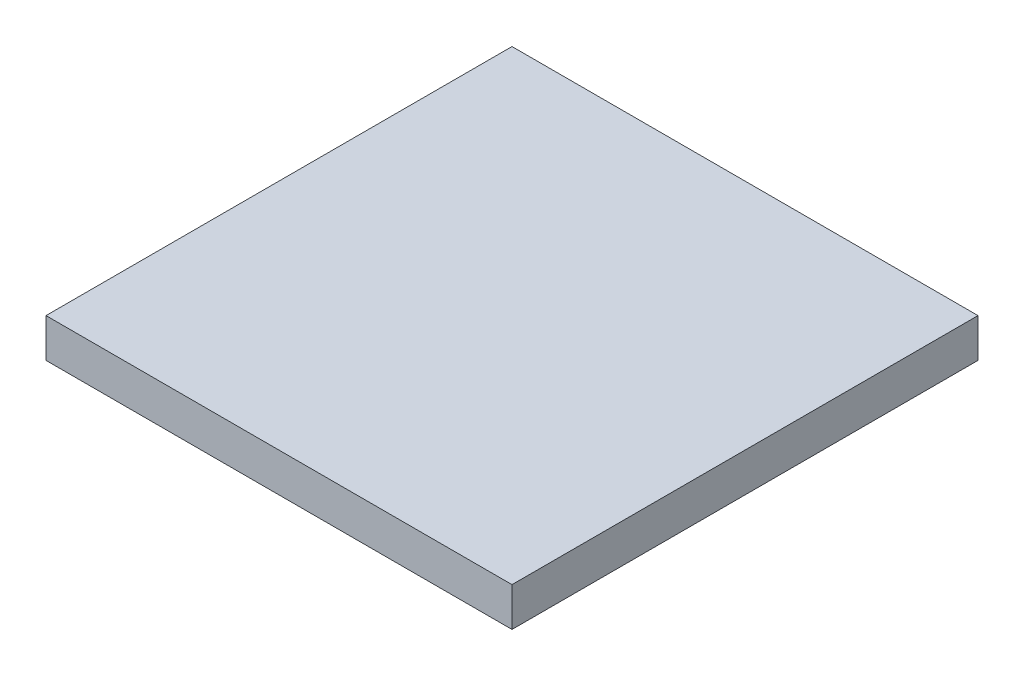
ISO-10303-21;
HEADER;
FILE_DESCRIPTION(('STEP AP214'),'2;1');
FILE_NAME('part.step','',(''),(''),'','','');
FILE_SCHEMA(('AUTOMOTIVE_DESIGN { 1 0 10303 214 1 1 1 1 }'));
ENDSEC;
DATA;
#1=APPLICATION_CONTEXT('core data for automotive mechanical design processes');
#2=APPLICATION_PROTOCOL_DEFINITION('international standard','automotive_design',2000,#1);
#3=PRODUCT_CONTEXT('',#1,'mechanical');
#4=PRODUCT('Part','Part','',(#3));
#5=PRODUCT_RELATED_PRODUCT_CATEGORY('part','',(#4));
#6=PRODUCT_DEFINITION_FORMATION('','',#4);
#7=PRODUCT_DEFINITION_CONTEXT('part definition',#1,'design');
#8=PRODUCT_DEFINITION('design','',#6,#7);
#9=PRODUCT_DEFINITION_SHAPE('','',#8);
#10=(LENGTH_UNIT() NAMED_UNIT(*) SI_UNIT(.MILLI.,.METRE.));
#11=(NAMED_UNIT(*) PLANE_ANGLE_UNIT() SI_UNIT($,.RADIAN.));
#12=(NAMED_UNIT(*) SI_UNIT($,.STERADIAN.) SOLID_ANGLE_UNIT());
#13=UNCERTAINTY_MEASURE_WITH_UNIT(LENGTH_MEASURE(1.E-05),#10,'distance_accuracy_value','');
#14=(GEOMETRIC_REPRESENTATION_CONTEXT(3) GLOBAL_UNCERTAINTY_ASSIGNED_CONTEXT((#13)) GLOBAL_UNIT_ASSIGNED_CONTEXT((#10,
#11,#12)) REPRESENTATION_CONTEXT('',''));
#15=CARTESIAN_POINT('',(0.,0.,0.));
#16=DIRECTION('',(0.,0.,1.));
#17=DIRECTION('',(1.,0.,0.));
#18=AXIS2_PLACEMENT_3D('',#15,#16,#17);
#19=CARTESIAN_POINT('',(0.,0.,0.));
#20=DIRECTION('',(0.,1.,0.));
#21=DIRECTION('',(0.,0.,1.));
#22=AXIS2_PLACEMENT_3D('',#19,#20,#21);
#23=PLANE('',#22);
#24=DIRECTION('',(-1.,0.,0.));
#25=VECTOR('',#24,1.);
#26=CARTESIAN_POINT('',(6.,0.,-6.));
#27=LINE('',#26,#25);
#28=CARTESIAN_POINT('',(6.,0.,-6.));
#29=VERTEX_POINT('',#28);
#30=CARTESIAN_POINT('',(-6.,0.,-6.));
#31=VERTEX_POINT('',#30);
#32=EDGE_CURVE('E20',#29,#31,#27,.T.);
#33=ORIENTED_EDGE('',*,*,#32,.F.);
#34=DIRECTION('',(0.,0.,-1.));
#35=VECTOR('',#34,1.);
#36=CARTESIAN_POINT('',(6.,0.,6.));
#37=LINE('',#36,#35);
#38=CARTESIAN_POINT('',(6.,0.,6.));
#39=VERTEX_POINT('',#38);
#40=EDGE_CURVE('E80',#39,#29,#37,.T.);
#41=ORIENTED_EDGE('',*,*,#40,.F.);
#42=DIRECTION('',(1.,0.,0.));
#43=VECTOR('',#42,1.);
#44=CARTESIAN_POINT('',(-6.,0.,6.));
#45=LINE('',#44,#43);
#46=CARTESIAN_POINT('',(-6.,0.,6.));
#47=VERTEX_POINT('',#46);
#48=EDGE_CURVE('E68',#47,#39,#45,.T.);
#49=ORIENTED_EDGE('',*,*,#48,.F.);
#50=DIRECTION('',(0.,0.,1.));
#51=VECTOR('',#50,1.);
#52=CARTESIAN_POINT('',(-6.,0.,-6.));
#53=LINE('',#52,#51);
#54=EDGE_CURVE('E55',#31,#47,#53,.T.);
#55=ORIENTED_EDGE('',*,*,#54,.F.);
#56=EDGE_LOOP('',(#33,#41,#49,#55));
#57=FACE_BOUND('',#56,.T.);
#58=ADVANCED_FACE('F17',(#57),#23,.F.);
#59=CARTESIAN_POINT('',(6.,0.,-6.));
#60=DIRECTION('',(0.,0.,-1.));
#61=DIRECTION('',(-1.,0.,0.));
#62=AXIS2_PLACEMENT_3D('',#59,#60,#61);
#63=PLANE('',#62);
#64=ORIENTED_EDGE('',*,*,#32,.T.);
#65=DIRECTION('',(0.,1.,0.));
#66=VECTOR('',#65,1.);
#67=CARTESIAN_POINT('',(-6.,0.,-6.));
#68=LINE('',#67,#66);
#69=CARTESIAN_POINT('',(-6.,1.,-6.));
#70=VERTEX_POINT('',#69);
#71=EDGE_CURVE('E61',#70,#31,#68,.F.);
#72=ORIENTED_EDGE('',*,*,#71,.F.);
#73=DIRECTION('',(1.,0.,0.));
#74=VECTOR('',#73,1.);
#75=CARTESIAN_POINT('',(0.,1.,-6.));
#76=LINE('',#75,#74);
#77=CARTESIAN_POINT('',(6.,1.,-6.));
#78=VERTEX_POINT('',#77);
#79=EDGE_CURVE('E83',#78,#70,#76,.F.);
#80=ORIENTED_EDGE('',*,*,#79,.F.);
#81=DIRECTION('',(0.,1.,0.));
#82=VECTOR('',#81,1.);
#83=CARTESIAN_POINT('',(6.,0.,-6.));
#84=LINE('',#83,#82);
#85=EDGE_CURVE('E64',#29,#78,#84,.T.);
#86=ORIENTED_EDGE('',*,*,#85,.F.);
#87=EDGE_LOOP('',(#64,#72,#80,#86));
#88=FACE_BOUND('',#87,.T.);
#89=ADVANCED_FACE('F60',(#88),#63,.T.);
#90=CARTESIAN_POINT('',(-6.,0.,-6.));
#91=DIRECTION('',(-1.,0.,0.));
#92=DIRECTION('',(0.,0.,1.));
#93=AXIS2_PLACEMENT_3D('',#90,#91,#92);
#94=PLANE('',#93);
#95=ORIENTED_EDGE('',*,*,#54,.T.);
#96=DIRECTION('',(0.,1.,0.));
#97=VECTOR('',#96,1.);
#98=CARTESIAN_POINT('',(-6.,0.,6.));
#99=LINE('',#98,#97);
#100=CARTESIAN_POINT('',(-6.,1.,6.));
#101=VERTEX_POINT('',#100);
#102=EDGE_CURVE('E70',#101,#47,#99,.F.);
#103=ORIENTED_EDGE('',*,*,#102,.F.);
#104=DIRECTION('',(0.,0.,1.));
#105=VECTOR('',#104,1.);
#106=CARTESIAN_POINT('',(-6.,1.,0.));
#107=LINE('',#106,#105);
#108=EDGE_CURVE('E74',#70,#101,#107,.T.);
#109=ORIENTED_EDGE('',*,*,#108,.F.);
#110=ORIENTED_EDGE('',*,*,#71,.T.);
#111=EDGE_LOOP('',(#95,#103,#109,#110));
#112=FACE_BOUND('',#111,.T.);
#113=ADVANCED_FACE('F72',(#112),#94,.T.);
#114=CARTESIAN_POINT('',(-6.,0.,6.));
#115=DIRECTION('',(0.,0.,1.));
#116=DIRECTION('',(1.,0.,0.));
#117=AXIS2_PLACEMENT_3D('',#114,#115,#116);
#118=PLANE('',#117);
#119=ORIENTED_EDGE('',*,*,#48,.T.);
#120=DIRECTION('',(0.,1.,0.));
#121=VECTOR('',#120,1.);
#122=CARTESIAN_POINT('',(6.,0.,6.));
#123=LINE('',#122,#121);
#124=CARTESIAN_POINT('',(6.,1.,6.));
#125=VERTEX_POINT('',#124);
#126=EDGE_CURVE('E35',#125,#39,#123,.F.);
#127=ORIENTED_EDGE('',*,*,#126,.F.);
#128=DIRECTION('',(1.,0.,0.));
#129=VECTOR('',#128,1.);
#130=CARTESIAN_POINT('',(0.,1.,6.));
#131=LINE('',#130,#129);
#132=EDGE_CURVE('E26',#101,#125,#131,.T.);
#133=ORIENTED_EDGE('',*,*,#132,.F.);
#134=ORIENTED_EDGE('',*,*,#102,.T.);
#135=EDGE_LOOP('',(#119,#127,#133,#134));
#136=FACE_BOUND('',#135,.T.);
#137=ADVANCED_FACE('F89',(#136),#118,.T.);
#138=CARTESIAN_POINT('',(6.,0.,6.));
#139=DIRECTION('',(1.,0.,0.));
#140=DIRECTION('',(0.,0.,-1.));
#141=AXIS2_PLACEMENT_3D('',#138,#139,#140);
#142=PLANE('',#141);
#143=ORIENTED_EDGE('',*,*,#40,.T.);
#144=ORIENTED_EDGE('',*,*,#85,.T.);
#145=DIRECTION('',(0.,0.,1.));
#146=VECTOR('',#145,1.);
#147=CARTESIAN_POINT('',(6.,1.,0.));
#148=LINE('',#147,#146);
#149=EDGE_CURVE('E11',#125,#78,#148,.F.);
#150=ORIENTED_EDGE('',*,*,#149,.F.);
#151=ORIENTED_EDGE('',*,*,#126,.T.);
#152=EDGE_LOOP('',(#143,#144,#150,#151));
#153=FACE_BOUND('',#152,.T.);
#154=ADVANCED_FACE('F91',(#153),#142,.T.);
#155=CARTESIAN_POINT('',(0.,1.,0.));
#156=DIRECTION('',(0.,1.,0.));
#157=DIRECTION('',(0.,0.,1.));
#158=AXIS2_PLACEMENT_3D('',#155,#156,#157);
#159=PLANE('',#158);
#160=ORIENTED_EDGE('',*,*,#132,.T.);
#161=ORIENTED_EDGE('',*,*,#149,.T.);
#162=ORIENTED_EDGE('',*,*,#79,.T.);
#163=ORIENTED_EDGE('',*,*,#108,.T.);
#164=EDGE_LOOP('',(#160,#161,#162,#163));
#165=FACE_BOUND('',#164,.T.);
#166=ADVANCED_FACE('F88',(#165),#159,.T.);
#167=CLOSED_SHELL('',(#58,#89,#113,#137,#154,#166));
#168=MANIFOLD_SOLID_BREP('B1',#167);
#169=ADVANCED_BREP_SHAPE_REPRESENTATION('',(#18,#168),#14);
#170=SHAPE_DEFINITION_REPRESENTATION(#9,#169);
ENDSEC;
END-ISO-10303-21;
